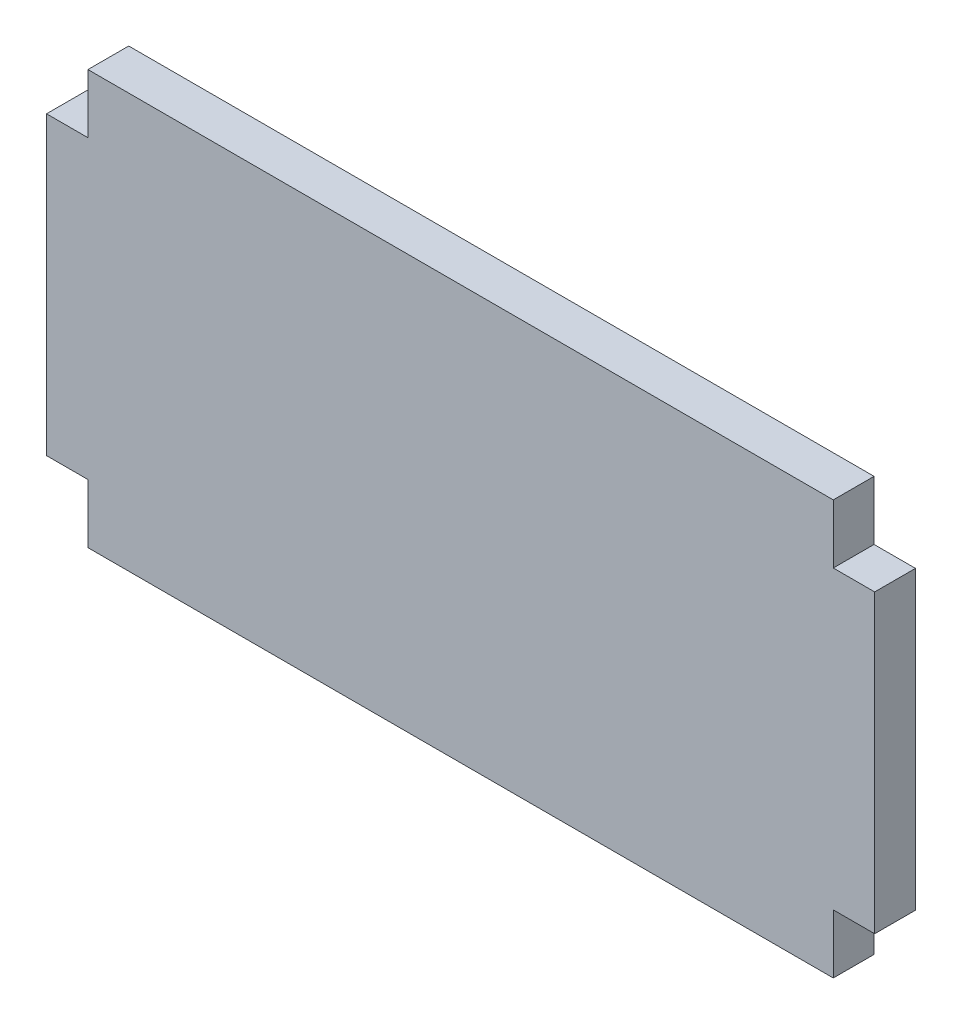
ISO-10303-21;
HEADER;
FILE_DESCRIPTION(('STEP AP214'),'2;1');
FILE_NAME('part.step','',(''),(''),'','','');
FILE_SCHEMA(('AUTOMOTIVE_DESIGN { 1 0 10303 214 1 1 1 1 }'));
ENDSEC;
DATA;
#1=APPLICATION_CONTEXT('core data for automotive mechanical design processes');
#2=APPLICATION_PROTOCOL_DEFINITION('international standard','automotive_design',2000,#1);
#3=PRODUCT_CONTEXT('',#1,'mechanical');
#4=PRODUCT('Part','Part','',(#3));
#5=PRODUCT_RELATED_PRODUCT_CATEGORY('part','',(#4));
#6=PRODUCT_DEFINITION_FORMATION('','',#4);
#7=PRODUCT_DEFINITION_CONTEXT('part definition',#1,'design');
#8=PRODUCT_DEFINITION('design','',#6,#7);
#9=PRODUCT_DEFINITION_SHAPE('','',#8);
#10=(LENGTH_UNIT() NAMED_UNIT(*) SI_UNIT(.MILLI.,.METRE.));
#11=(NAMED_UNIT(*) PLANE_ANGLE_UNIT() SI_UNIT($,.RADIAN.));
#12=(NAMED_UNIT(*) SI_UNIT($,.STERADIAN.) SOLID_ANGLE_UNIT());
#13=UNCERTAINTY_MEASURE_WITH_UNIT(LENGTH_MEASURE(1.E-05),#10,'distance_accuracy_value','');
#14=(GEOMETRIC_REPRESENTATION_CONTEXT(3) GLOBAL_UNCERTAINTY_ASSIGNED_CONTEXT((#13)) GLOBAL_UNIT_ASSIGNED_CONTEXT((#10,
#11,#12)) REPRESENTATION_CONTEXT('',''));
#15=CARTESIAN_POINT('',(0.,0.,0.));
#16=DIRECTION('',(0.,0.,1.));
#17=DIRECTION('',(1.,0.,0.));
#18=AXIS2_PLACEMENT_3D('',#15,#16,#17);
#19=CARTESIAN_POINT('',(45.72,25.4,5.0038));
#20=DIRECTION('',(0.,-1.,0.));
#21=DIRECTION('',(0.,0.,-1.));
#22=AXIS2_PLACEMENT_3D('',#19,#20,#21);
#23=PLANE('',#22);
#24=DIRECTION('',(-1.,0.,0.));
#25=VECTOR('',#24,1.);
#26=CARTESIAN_POINT('',(45.72,25.4,0.));
#27=LINE('',#26,#25);
#28=CARTESIAN_POINT('',(45.72,25.4,0.));
#29=VERTEX_POINT('',#28);
#30=CARTESIAN_POINT('',(-45.72,25.4,0.));
#31=VERTEX_POINT('',#30);
#32=EDGE_CURVE('E155',#29,#31,#27,.T.);
#33=ORIENTED_EDGE('',*,*,#32,.T.);
#34=DIRECTION('',(0.,0.,-1.));
#35=VECTOR('',#34,1.);
#36=CARTESIAN_POINT('',(-45.72,25.4,5.0038));
#37=LINE('',#36,#35);
#38=CARTESIAN_POINT('',(-45.72,25.4,5.0038));
#39=VERTEX_POINT('',#38);
#40=EDGE_CURVE('E11',#39,#31,#37,.T.);
#41=ORIENTED_EDGE('',*,*,#40,.F.);
#42=DIRECTION('',(-1.,0.,0.));
#43=VECTOR('',#42,1.);
#44=CARTESIAN_POINT('',(45.72,25.4,5.0038));
#45=LINE('',#44,#43);
#46=CARTESIAN_POINT('',(45.72,25.4,5.0038));
#47=VERTEX_POINT('',#46);
#48=EDGE_CURVE('E177',#47,#39,#45,.T.);
#49=ORIENTED_EDGE('',*,*,#48,.F.);
#50=DIRECTION('',(0.,0.,-1.));
#51=VECTOR('',#50,1.);
#52=CARTESIAN_POINT('',(45.72,25.4,5.0038));
#53=LINE('',#52,#51);
#54=EDGE_CURVE('E151',#47,#29,#53,.T.);
#55=ORIENTED_EDGE('',*,*,#54,.T.);
#56=EDGE_LOOP('',(#33,#41,#49,#55));
#57=FACE_BOUND('',#56,.T.);
#58=ADVANCED_FACE('F35',(#57),#23,.F.);
#59=CARTESIAN_POINT('',(-45.72,25.4,5.0038));
#60=DIRECTION('',(1.,0.,0.));
#61=DIRECTION('',(0.,0.,-1.));
#62=AXIS2_PLACEMENT_3D('',#59,#60,#61);
#63=PLANE('',#62);
#64=DIRECTION('',(0.,-1.,0.));
#65=VECTOR('',#64,1.);
#66=CARTESIAN_POINT('',(-45.72,25.4,0.));
#67=LINE('',#66,#65);
#68=CARTESIAN_POINT('',(-45.72,18.161,0.));
#69=VERTEX_POINT('',#68);
#70=EDGE_CURVE('E158',#31,#69,#67,.T.);
#71=ORIENTED_EDGE('',*,*,#70,.T.);
#72=DIRECTION('',(0.,0.,-1.));
#73=VECTOR('',#72,1.);
#74=CARTESIAN_POINT('',(-45.72,18.161,5.0038));
#75=LINE('',#74,#73);
#76=CARTESIAN_POINT('',(-45.72,18.161,5.0038));
#77=VERTEX_POINT('',#76);
#78=EDGE_CURVE('E43',#77,#69,#75,.T.);
#79=ORIENTED_EDGE('',*,*,#78,.F.);
#80=DIRECTION('',(0.,-1.,0.));
#81=VECTOR('',#80,1.);
#82=CARTESIAN_POINT('',(-45.72,25.4,5.0038));
#83=LINE('',#82,#81);
#84=EDGE_CURVE('E106',#39,#77,#83,.T.);
#85=ORIENTED_EDGE('',*,*,#84,.F.);
#86=ORIENTED_EDGE('',*,*,#40,.T.);
#87=EDGE_LOOP('',(#71,#79,#85,#86));
#88=FACE_BOUND('',#87,.T.);
#89=ADVANCED_FACE('F255',(#88),#63,.F.);
#90=CARTESIAN_POINT('',(-45.72,18.161,5.0038));
#91=DIRECTION('',(0.,-1.,0.));
#92=DIRECTION('',(0.,0.,-1.));
#93=AXIS2_PLACEMENT_3D('',#90,#91,#92);
#94=PLANE('',#93);
#95=DIRECTION('',(-1.,0.,0.));
#96=VECTOR('',#95,1.);
#97=CARTESIAN_POINT('',(-45.72,18.161,0.));
#98=LINE('',#97,#96);
#99=CARTESIAN_POINT('',(-50.8,18.161,0.));
#100=VERTEX_POINT('',#99);
#101=EDGE_CURVE('E160',#69,#100,#98,.T.);
#102=ORIENTED_EDGE('',*,*,#101,.T.);
#103=DIRECTION('',(0.,0.,-1.));
#104=VECTOR('',#103,1.);
#105=CARTESIAN_POINT('',(-50.8,18.161,5.0038));
#106=LINE('',#105,#104);
#107=CARTESIAN_POINT('',(-50.8,18.161,5.0038));
#108=VERTEX_POINT('',#107);
#109=EDGE_CURVE('E196',#108,#100,#106,.T.);
#110=ORIENTED_EDGE('',*,*,#109,.F.);
#111=DIRECTION('',(-1.,0.,0.));
#112=VECTOR('',#111,1.);
#113=CARTESIAN_POINT('',(-45.72,18.161,5.0038));
#114=LINE('',#113,#112);
#115=EDGE_CURVE('E204',#77,#108,#114,.T.);
#116=ORIENTED_EDGE('',*,*,#115,.F.);
#117=ORIENTED_EDGE('',*,*,#78,.T.);
#118=EDGE_LOOP('',(#102,#110,#116,#117));
#119=FACE_BOUND('',#118,.T.);
#120=ADVANCED_FACE('F202',(#119),#94,.F.);
#121=CARTESIAN_POINT('',(-50.8,18.161,5.0038));
#122=DIRECTION('',(1.,0.,0.));
#123=DIRECTION('',(0.,1.,0.));
#124=AXIS2_PLACEMENT_3D('',#121,#122,#123);
#125=PLANE('',#124);
#126=DIRECTION('',(0.,-1.,0.));
#127=VECTOR('',#126,1.);
#128=CARTESIAN_POINT('',(-50.8,18.161,0.));
#129=LINE('',#128,#127);
#130=CARTESIAN_POINT('',(-50.8,-18.161,0.));
#131=VERTEX_POINT('',#130);
#132=EDGE_CURVE('E162',#100,#131,#129,.T.);
#133=ORIENTED_EDGE('',*,*,#132,.T.);
#134=DIRECTION('',(0.,0.,-1.));
#135=VECTOR('',#134,1.);
#136=CARTESIAN_POINT('',(-50.8,-18.161,5.0038));
#137=LINE('',#136,#135);
#138=CARTESIAN_POINT('',(-50.8,-18.161,5.0038));
#139=VERTEX_POINT('',#138);
#140=EDGE_CURVE('E193',#139,#131,#137,.T.);
#141=ORIENTED_EDGE('',*,*,#140,.F.);
#142=DIRECTION('',(0.,-1.,0.));
#143=VECTOR('',#142,1.);
#144=CARTESIAN_POINT('',(-50.8,18.161,5.0038));
#145=LINE('',#144,#143);
#146=EDGE_CURVE('E222',#108,#139,#145,.T.);
#147=ORIENTED_EDGE('',*,*,#146,.F.);
#148=ORIENTED_EDGE('',*,*,#109,.T.);
#149=EDGE_LOOP('',(#133,#141,#147,#148));
#150=FACE_BOUND('',#149,.T.);
#151=ADVANCED_FACE('F213',(#150),#125,.F.);
#152=CARTESIAN_POINT('',(-45.72,-18.161,5.0038));
#153=DIRECTION('',(0.,1.,0.));
#154=DIRECTION('',(0.,0.,1.));
#155=AXIS2_PLACEMENT_3D('',#152,#153,#154);
#156=PLANE('',#155);
#157=DIRECTION('',(1.,0.,0.));
#158=VECTOR('',#157,1.);
#159=CARTESIAN_POINT('',(-45.72,-18.161,0.));
#160=LINE('',#159,#158);
#161=CARTESIAN_POINT('',(-45.72,-18.161,0.));
#162=VERTEX_POINT('',#161);
#163=EDGE_CURVE('E164',#131,#162,#160,.T.);
#164=ORIENTED_EDGE('',*,*,#163,.T.);
#165=DIRECTION('',(0.,0.,-1.));
#166=VECTOR('',#165,1.);
#167=CARTESIAN_POINT('',(-45.72,-18.161,5.0038));
#168=LINE('',#167,#166);
#169=CARTESIAN_POINT('',(-45.72,-18.161,5.0038));
#170=VERTEX_POINT('',#169);
#171=EDGE_CURVE('E190',#170,#162,#168,.T.);
#172=ORIENTED_EDGE('',*,*,#171,.F.);
#173=DIRECTION('',(1.,0.,0.));
#174=VECTOR('',#173,1.);
#175=CARTESIAN_POINT('',(-45.72,-18.161,5.0038));
#176=LINE('',#175,#174);
#177=EDGE_CURVE('E219',#139,#170,#176,.T.);
#178=ORIENTED_EDGE('',*,*,#177,.F.);
#179=ORIENTED_EDGE('',*,*,#140,.T.);
#180=EDGE_LOOP('',(#164,#172,#178,#179));
#181=FACE_BOUND('',#180,.T.);
#182=ADVANCED_FACE('F217',(#181),#156,.F.);
#183=CARTESIAN_POINT('',(-45.72,-25.4,5.0038));
#184=DIRECTION('',(1.,0.,0.));
#185=DIRECTION('',(0.,0.,-1.));
#186=AXIS2_PLACEMENT_3D('',#183,#184,#185);
#187=PLANE('',#186);
#188=DIRECTION('',(0.,-1.,0.));
#189=VECTOR('',#188,1.);
#190=CARTESIAN_POINT('',(-45.72,-25.4,0.));
#191=LINE('',#190,#189);
#192=CARTESIAN_POINT('',(-45.72,-25.4,0.));
#193=VERTEX_POINT('',#192);
#194=EDGE_CURVE('E166',#162,#193,#191,.T.);
#195=ORIENTED_EDGE('',*,*,#194,.T.);
#196=DIRECTION('',(0.,0.,-1.));
#197=VECTOR('',#196,1.);
#198=CARTESIAN_POINT('',(-45.72,-25.4,5.0038));
#199=LINE('',#198,#197);
#200=CARTESIAN_POINT('',(-45.72,-25.4,5.0038));
#201=VERTEX_POINT('',#200);
#202=EDGE_CURVE('E187',#201,#193,#199,.T.);
#203=ORIENTED_EDGE('',*,*,#202,.F.);
#204=DIRECTION('',(0.,-1.,0.));
#205=VECTOR('',#204,1.);
#206=CARTESIAN_POINT('',(-45.72,-25.4,5.0038));
#207=LINE('',#206,#205);
#208=EDGE_CURVE('E221',#170,#201,#207,.T.);
#209=ORIENTED_EDGE('',*,*,#208,.F.);
#210=ORIENTED_EDGE('',*,*,#171,.T.);
#211=EDGE_LOOP('',(#195,#203,#209,#210));
#212=FACE_BOUND('',#211,.T.);
#213=ADVANCED_FACE('F268',(#212),#187,.F.);
#214=CARTESIAN_POINT('',(45.72,-25.4,5.0038));
#215=DIRECTION('',(0.,1.,0.));
#216=DIRECTION('',(0.,0.,1.));
#217=AXIS2_PLACEMENT_3D('',#214,#215,#216);
#218=PLANE('',#217);
#219=DIRECTION('',(1.,0.,0.));
#220=VECTOR('',#219,1.);
#221=CARTESIAN_POINT('',(45.72,-25.4,0.));
#222=LINE('',#221,#220);
#223=CARTESIAN_POINT('',(45.72,-25.4,0.));
#224=VERTEX_POINT('',#223);
#225=EDGE_CURVE('E168',#193,#224,#222,.T.);
#226=ORIENTED_EDGE('',*,*,#225,.T.);
#227=DIRECTION('',(0.,0.,-1.));
#228=VECTOR('',#227,1.);
#229=CARTESIAN_POINT('',(45.72,-25.4,5.0038));
#230=LINE('',#229,#228);
#231=CARTESIAN_POINT('',(45.72,-25.4,5.0038));
#232=VERTEX_POINT('',#231);
#233=EDGE_CURVE('E184',#232,#224,#230,.T.);
#234=ORIENTED_EDGE('',*,*,#233,.F.);
#235=DIRECTION('',(1.,0.,0.));
#236=VECTOR('',#235,1.);
#237=CARTESIAN_POINT('',(45.72,-25.4,5.0038));
#238=LINE('',#237,#236);
#239=EDGE_CURVE('E224',#201,#232,#238,.T.);
#240=ORIENTED_EDGE('',*,*,#239,.F.);
#241=ORIENTED_EDGE('',*,*,#202,.T.);
#242=EDGE_LOOP('',(#226,#234,#240,#241));
#243=FACE_BOUND('',#242,.T.);
#244=ADVANCED_FACE('F271',(#243),#218,.F.);
#245=CARTESIAN_POINT('',(45.72,-25.4,5.0038));
#246=DIRECTION('',(-1.,0.,0.));
#247=DIRECTION('',(0.,0.,1.));
#248=AXIS2_PLACEMENT_3D('',#245,#246,#247);
#249=PLANE('',#248);
#250=DIRECTION('',(0.,1.,0.));
#251=VECTOR('',#250,1.);
#252=CARTESIAN_POINT('',(45.72,-25.4,0.));
#253=LINE('',#252,#251);
#254=CARTESIAN_POINT('',(45.72,-18.161,0.));
#255=VERTEX_POINT('',#254);
#256=EDGE_CURVE('E170',#224,#255,#253,.T.);
#257=ORIENTED_EDGE('',*,*,#256,.T.);
#258=DIRECTION('',(0.,0.,-1.));
#259=VECTOR('',#258,1.);
#260=CARTESIAN_POINT('',(45.72,-18.161,5.0038));
#261=LINE('',#260,#259);
#262=CARTESIAN_POINT('',(45.72,-18.161,5.0038));
#263=VERTEX_POINT('',#262);
#264=EDGE_CURVE('E181',#263,#255,#261,.T.);
#265=ORIENTED_EDGE('',*,*,#264,.F.);
#266=DIRECTION('',(0.,1.,0.));
#267=VECTOR('',#266,1.);
#268=CARTESIAN_POINT('',(45.72,-25.4,5.0038));
#269=LINE('',#268,#267);
#270=EDGE_CURVE('E230',#232,#263,#269,.T.);
#271=ORIENTED_EDGE('',*,*,#270,.F.);
#272=ORIENTED_EDGE('',*,*,#233,.T.);
#273=EDGE_LOOP('',(#257,#265,#271,#272));
#274=FACE_BOUND('',#273,.T.);
#275=ADVANCED_FACE('F236',(#274),#249,.F.);
#276=CARTESIAN_POINT('',(45.72,-18.161,5.0038));
#277=DIRECTION('',(0.,1.,0.));
#278=DIRECTION('',(0.,0.,1.));
#279=AXIS2_PLACEMENT_3D('',#276,#277,#278);
#280=PLANE('',#279);
#281=DIRECTION('',(1.,0.,0.));
#282=VECTOR('',#281,1.);
#283=CARTESIAN_POINT('',(45.72,-18.161,0.));
#284=LINE('',#283,#282);
#285=CARTESIAN_POINT('',(50.8,-18.161,0.));
#286=VERTEX_POINT('',#285);
#287=EDGE_CURVE('E172',#255,#286,#284,.T.);
#288=ORIENTED_EDGE('',*,*,#287,.T.);
#289=DIRECTION('',(0.,0.,-1.));
#290=VECTOR('',#289,1.);
#291=CARTESIAN_POINT('',(50.8,-18.161,5.0038));
#292=LINE('',#291,#290);
#293=CARTESIAN_POINT('',(50.8,-18.161,5.0038));
#294=VERTEX_POINT('',#293);
#295=EDGE_CURVE('E146',#294,#286,#292,.T.);
#296=ORIENTED_EDGE('',*,*,#295,.F.);
#297=DIRECTION('',(1.,0.,0.));
#298=VECTOR('',#297,1.);
#299=CARTESIAN_POINT('',(45.72,-18.161,5.0038));
#300=LINE('',#299,#298);
#301=EDGE_CURVE('E137',#263,#294,#300,.T.);
#302=ORIENTED_EDGE('',*,*,#301,.F.);
#303=ORIENTED_EDGE('',*,*,#264,.T.);
#304=EDGE_LOOP('',(#288,#296,#302,#303));
#305=FACE_BOUND('',#304,.T.);
#306=ADVANCED_FACE('F240',(#305),#280,.F.);
#307=CARTESIAN_POINT('',(50.8,18.161,5.0038));
#308=DIRECTION('',(-1.,0.,0.));
#309=DIRECTION('',(0.,-1.,0.));
#310=AXIS2_PLACEMENT_3D('',#307,#308,#309);
#311=PLANE('',#310);
#312=DIRECTION('',(0.,1.,0.));
#313=VECTOR('',#312,1.);
#314=CARTESIAN_POINT('',(50.8,18.161,0.));
#315=LINE('',#314,#313);
#316=CARTESIAN_POINT('',(50.8,18.161,0.));
#317=VERTEX_POINT('',#316);
#318=EDGE_CURVE('E145',#286,#317,#315,.T.);
#319=ORIENTED_EDGE('',*,*,#318,.T.);
#320=DIRECTION('',(0.,0.,-1.));
#321=VECTOR('',#320,1.);
#322=CARTESIAN_POINT('',(50.8,18.161,5.0038));
#323=LINE('',#322,#321);
#324=CARTESIAN_POINT('',(50.8,18.161,5.0038));
#325=VERTEX_POINT('',#324);
#326=EDGE_CURVE('E142',#325,#317,#323,.T.);
#327=ORIENTED_EDGE('',*,*,#326,.F.);
#328=DIRECTION('',(0.,1.,0.));
#329=VECTOR('',#328,1.);
#330=CARTESIAN_POINT('',(50.8,18.161,5.0038));
#331=LINE('',#330,#329);
#332=EDGE_CURVE('E131',#294,#325,#331,.T.);
#333=ORIENTED_EDGE('',*,*,#332,.F.);
#334=ORIENTED_EDGE('',*,*,#295,.T.);
#335=EDGE_LOOP('',(#319,#327,#333,#334));
#336=FACE_BOUND('',#335,.T.);
#337=ADVANCED_FACE('F143',(#336),#311,.F.);
#338=CARTESIAN_POINT('',(45.72,18.161,5.0038));
#339=DIRECTION('',(0.,-1.,0.));
#340=DIRECTION('',(0.,0.,-1.));
#341=AXIS2_PLACEMENT_3D('',#338,#339,#340);
#342=PLANE('',#341);
#343=DIRECTION('',(-1.,0.,0.));
#344=VECTOR('',#343,1.);
#345=CARTESIAN_POINT('',(45.72,18.161,0.));
#346=LINE('',#345,#344);
#347=CARTESIAN_POINT('',(45.72,18.161,0.));
#348=VERTEX_POINT('',#347);
#349=EDGE_CURVE('E92',#317,#348,#346,.T.);
#350=ORIENTED_EDGE('',*,*,#349,.T.);
#351=DIRECTION('',(0.,0.,-1.));
#352=VECTOR('',#351,1.);
#353=CARTESIAN_POINT('',(45.72,18.161,5.0038));
#354=LINE('',#353,#352);
#355=CARTESIAN_POINT('',(45.72,18.161,5.0038));
#356=VERTEX_POINT('',#355);
#357=EDGE_CURVE('E147',#356,#348,#354,.T.);
#358=ORIENTED_EDGE('',*,*,#357,.F.);
#359=DIRECTION('',(-1.,0.,0.));
#360=VECTOR('',#359,1.);
#361=CARTESIAN_POINT('',(45.72,18.161,5.0038));
#362=LINE('',#361,#360);
#363=EDGE_CURVE('E135',#325,#356,#362,.T.);
#364=ORIENTED_EDGE('',*,*,#363,.F.);
#365=ORIENTED_EDGE('',*,*,#326,.T.);
#366=EDGE_LOOP('',(#350,#358,#364,#365));
#367=FACE_BOUND('',#366,.T.);
#368=ADVANCED_FACE('F149',(#367),#342,.F.);
#369=CARTESIAN_POINT('',(45.72,25.4,5.0038));
#370=DIRECTION('',(-1.,0.,0.));
#371=DIRECTION('',(0.,0.,1.));
#372=AXIS2_PLACEMENT_3D('',#369,#370,#371);
#373=PLANE('',#372);
#374=DIRECTION('',(0.,1.,0.));
#375=VECTOR('',#374,1.);
#376=CARTESIAN_POINT('',(45.72,25.4,0.));
#377=LINE('',#376,#375);
#378=EDGE_CURVE('E98',#348,#29,#377,.T.);
#379=ORIENTED_EDGE('',*,*,#378,.T.);
#380=ORIENTED_EDGE('',*,*,#54,.F.);
#381=DIRECTION('',(0.,1.,0.));
#382=VECTOR('',#381,1.);
#383=CARTESIAN_POINT('',(45.72,25.4,5.0038));
#384=LINE('',#383,#382);
#385=EDGE_CURVE('E51',#356,#47,#384,.T.);
#386=ORIENTED_EDGE('',*,*,#385,.F.);
#387=ORIENTED_EDGE('',*,*,#357,.T.);
#388=EDGE_LOOP('',(#379,#380,#386,#387));
#389=FACE_BOUND('',#388,.T.);
#390=ADVANCED_FACE('F244',(#389),#373,.F.);
#391=CARTESIAN_POINT('',(-45.72,25.4,5.0038));
#392=DIRECTION('',(0.,0.,1.));
#393=DIRECTION('',(1.,0.,0.));
#394=AXIS2_PLACEMENT_3D('',#391,#392,#393);
#395=PLANE('',#394);
#396=ORIENTED_EDGE('',*,*,#48,.T.);
#397=ORIENTED_EDGE('',*,*,#84,.T.);
#398=ORIENTED_EDGE('',*,*,#115,.T.);
#399=ORIENTED_EDGE('',*,*,#146,.T.);
#400=ORIENTED_EDGE('',*,*,#177,.T.);
#401=ORIENTED_EDGE('',*,*,#208,.T.);
#402=ORIENTED_EDGE('',*,*,#239,.T.);
#403=ORIENTED_EDGE('',*,*,#270,.T.);
#404=ORIENTED_EDGE('',*,*,#301,.T.);
#405=ORIENTED_EDGE('',*,*,#332,.T.);
#406=ORIENTED_EDGE('',*,*,#363,.T.);
#407=ORIENTED_EDGE('',*,*,#385,.T.);
#408=EDGE_LOOP('',(#396,#397,#398,#399,#400,#401,#402,#403,#404,#405,#406,#407));
#409=FACE_BOUND('',#408,.T.);
#410=ADVANCED_FACE('F133',(#409),#395,.T.);
#411=CARTESIAN_POINT('',(-45.72,25.4,0.));
#412=DIRECTION('',(0.,0.,1.));
#413=DIRECTION('',(1.,0.,0.));
#414=AXIS2_PLACEMENT_3D('',#411,#412,#413);
#415=PLANE('',#414);
#416=ORIENTED_EDGE('',*,*,#32,.F.);
#417=ORIENTED_EDGE('',*,*,#378,.F.);
#418=ORIENTED_EDGE('',*,*,#349,.F.);
#419=ORIENTED_EDGE('',*,*,#318,.F.);
#420=ORIENTED_EDGE('',*,*,#287,.F.);
#421=ORIENTED_EDGE('',*,*,#256,.F.);
#422=ORIENTED_EDGE('',*,*,#225,.F.);
#423=ORIENTED_EDGE('',*,*,#194,.F.);
#424=ORIENTED_EDGE('',*,*,#163,.F.);
#425=ORIENTED_EDGE('',*,*,#132,.F.);
#426=ORIENTED_EDGE('',*,*,#101,.F.);
#427=ORIENTED_EDGE('',*,*,#70,.F.);
#428=EDGE_LOOP('',(#416,#417,#418,#419,#420,#421,#422,#423,#424,#425,#426,#427));
#429=FACE_BOUND('',#428,.T.);
#430=ADVANCED_FACE('F208',(#429),#415,.F.);
#431=CLOSED_SHELL('',(#58,#89,#120,#151,#182,#213,#244,#275,#306,#337,#368,#390,#410,#430));
#432=MANIFOLD_SOLID_BREP('B2',#431);
#433=ADVANCED_BREP_SHAPE_REPRESENTATION('',(#18,#432),#14);
#434=SHAPE_DEFINITION_REPRESENTATION(#9,#433);
ENDSEC;
END-ISO-10303-21;
